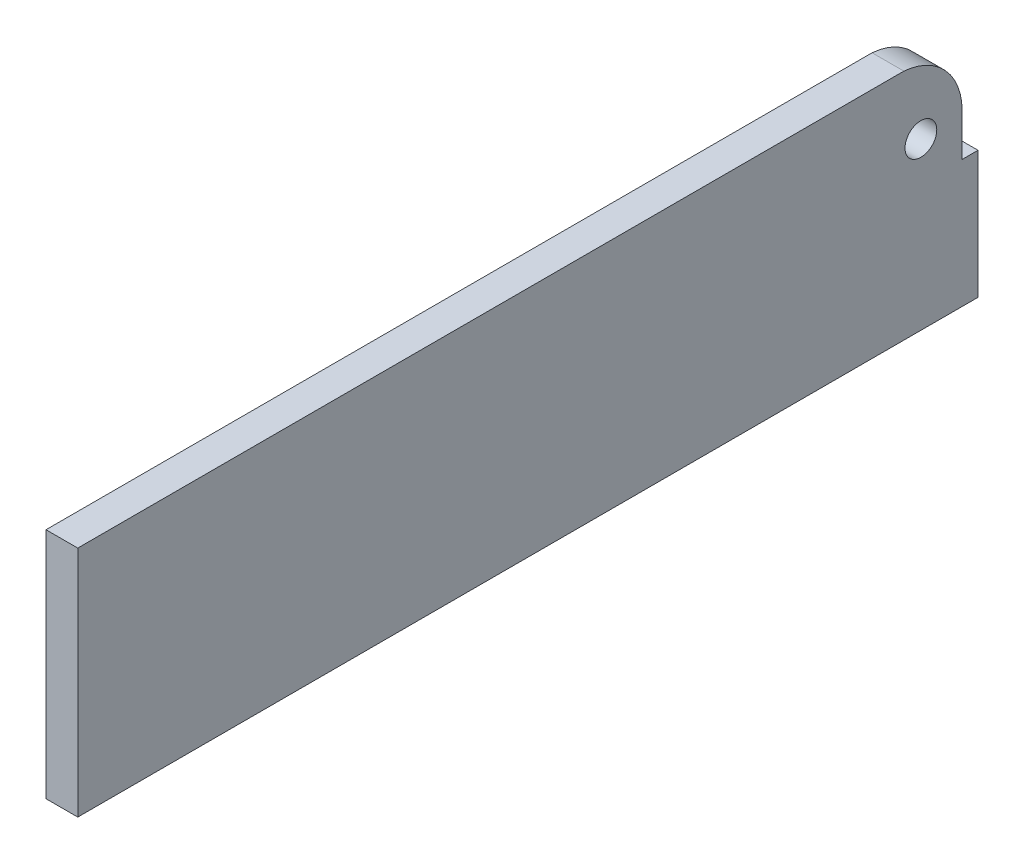
ISO-10303-21;
HEADER;
FILE_DESCRIPTION(('STEP AP214'),'2;1');
FILE_NAME('part.step','',(''),(''),'','','');
FILE_SCHEMA(('AUTOMOTIVE_DESIGN { 1 0 10303 214 1 1 1 1 }'));
ENDSEC;
DATA;
#1=APPLICATION_CONTEXT('core data for automotive mechanical design processes');
#2=APPLICATION_PROTOCOL_DEFINITION('international standard','automotive_design',2000,#1);
#3=PRODUCT_CONTEXT('',#1,'mechanical');
#4=PRODUCT('Part','Part','',(#3));
#5=PRODUCT_RELATED_PRODUCT_CATEGORY('part','',(#4));
#6=PRODUCT_DEFINITION_FORMATION('','',#4);
#7=PRODUCT_DEFINITION_CONTEXT('part definition',#1,'design');
#8=PRODUCT_DEFINITION('design','',#6,#7);
#9=PRODUCT_DEFINITION_SHAPE('','',#8);
#10=(LENGTH_UNIT() NAMED_UNIT(*) SI_UNIT(.MILLI.,.METRE.));
#11=(NAMED_UNIT(*) PLANE_ANGLE_UNIT() SI_UNIT($,.RADIAN.));
#12=(NAMED_UNIT(*) SI_UNIT($,.STERADIAN.) SOLID_ANGLE_UNIT());
#13=UNCERTAINTY_MEASURE_WITH_UNIT(LENGTH_MEASURE(1.E-05),#10,'distance_accuracy_value','');
#14=(GEOMETRIC_REPRESENTATION_CONTEXT(3) GLOBAL_UNCERTAINTY_ASSIGNED_CONTEXT((#13)) GLOBAL_UNIT_ASSIGNED_CONTEXT((#10,
#11,#12)) REPRESENTATION_CONTEXT('',''));
#15=CARTESIAN_POINT('',(0.,0.,0.));
#16=DIRECTION('',(0.,0.,1.));
#17=DIRECTION('',(1.,0.,0.));
#18=AXIS2_PLACEMENT_3D('',#15,#16,#17);
#19=CARTESIAN_POINT('',(3.,5.52642049622653,-35.0087088921518));
#20=DIRECTION('',(-1.,0.,0.));
#21=DIRECTION('',(0.,0.,1.));
#22=AXIS2_PLACEMENT_3D('',#19,#20,#21);
#23=PLANE('',#22);
#24=DIRECTION('',(0.,-1.,0.));
#25=VECTOR('',#24,1.);
#26=CARTESIAN_POINT('',(3.,-10.5024655217488,42.5));
#27=LINE('',#26,#25);
#28=CARTESIAN_POINT('',(3.,11.4975344782512,42.5));
#29=VERTEX_POINT('',#28);
#30=CARTESIAN_POINT('',(3.,-10.5024655217488,42.5));
#31=VERTEX_POINT('',#30);
#32=EDGE_CURVE('E136',#29,#31,#27,.T.);
#33=ORIENTED_EDGE('',*,*,#32,.T.);
#34=DIRECTION('',(0.,0.,-1.));
#35=VECTOR('',#34,1.);
#36=CARTESIAN_POINT('',(3.,-10.5024655217488,42.5));
#37=LINE('',#36,#35);
#38=CARTESIAN_POINT('',(3.,-10.5024655217488,-42.5));
#39=VERTEX_POINT('',#38);
#40=EDGE_CURVE('E89',#31,#39,#37,.T.);
#41=ORIENTED_EDGE('',*,*,#40,.T.);
#42=DIRECTION('',(0.,1.,0.));
#43=VECTOR('',#42,1.);
#44=CARTESIAN_POINT('',(3.,-10.5024655217488,-42.5));
#45=LINE('',#44,#43);
#46=CARTESIAN_POINT('',(3.,1.52642049622653,-42.5));
#47=VERTEX_POINT('',#46);
#48=EDGE_CURVE('E148',#39,#47,#45,.T.);
#49=ORIENTED_EDGE('',*,*,#48,.T.);
#50=DIRECTION('',(0.,0.,1.));
#51=VECTOR('',#50,1.);
#52=CARTESIAN_POINT('',(3.,1.52642049622653,-41.));
#53=LINE('',#52,#51);
#54=CARTESIAN_POINT('',(3.,1.52642049622653,-41.));
#55=VERTEX_POINT('',#54);
#56=EDGE_CURVE('E105',#47,#55,#53,.T.);
#57=ORIENTED_EDGE('',*,*,#56,.T.);
#58=DIRECTION('',(0.,1.,0.));
#59=VECTOR('',#58,1.);
#60=CARTESIAN_POINT('',(3.,1.52642049622653,-41.));
#61=LINE('',#60,#59);
#62=CARTESIAN_POINT('',(3.,5.52642049622654,-41.));
#63=VERTEX_POINT('',#62);
#64=EDGE_CURVE('E99',#55,#63,#61,.T.);
#65=ORIENTED_EDGE('',*,*,#64,.T.);
#66=CARTESIAN_POINT('',(3.,5.52642049622653,-35.0087088921518));
#67=DIRECTION('',(1.,0.,0.));
#68=DIRECTION('',(0.,0.,1.));
#69=AXIS2_PLACEMENT_3D('',#66,#67,#68);
#70=CIRCLE('',#69,5.99129110784822);
#71=CARTESIAN_POINT('',(3.,11.4975344782512,-35.5));
#72=VERTEX_POINT('',#71);
#73=EDGE_CURVE('E103',#63,#72,#70,.T.);
#74=ORIENTED_EDGE('',*,*,#73,.T.);
#75=DIRECTION('',(0.,0.,1.));
#76=VECTOR('',#75,1.);
#77=CARTESIAN_POINT('',(3.,11.4975344782512,42.5));
#78=LINE('',#77,#76);
#79=EDGE_CURVE('E49',#72,#29,#78,.T.);
#80=ORIENTED_EDGE('',*,*,#79,.T.);
#81=EDGE_LOOP('',(#33,#41,#49,#57,#65,#74,#80));
#82=FACE_BOUND('',#81,.T.);
#83=CARTESIAN_POINT('',(3.,5.14776980357318,-37.1070068157879));
#84=DIRECTION('',(1.,0.,0.));
#85=DIRECTION('',(0.,0.,-1.));
#86=AXIS2_PLACEMENT_3D('',#83,#84,#85);
#87=CIRCLE('',#86,1.5);
#88=CARTESIAN_POINT('',(3.,5.14776980357318,-38.6070068157879));
#89=VERTEX_POINT('',#88);
#90=EDGE_CURVE('E127',#89,#89,#87,.T.);
#91=ORIENTED_EDGE('',*,*,#90,.F.);
#92=EDGE_LOOP('',(#91));
#93=FACE_BOUND('',#92,.T.);
#94=ADVANCED_FACE('F32',(#82,#93),#23,.F.);
#95=CARTESIAN_POINT('',(0.,5.52642049622653,-35.0087088921518));
#96=DIRECTION('',(-1.,0.,0.));
#97=DIRECTION('',(0.,0.,1.));
#98=AXIS2_PLACEMENT_3D('',#95,#96,#97);
#99=PLANE('',#98);
#100=DIRECTION('',(0.,-1.,0.));
#101=VECTOR('',#100,1.);
#102=CARTESIAN_POINT('',(0.,-10.5024655217488,42.5));
#103=LINE('',#102,#101);
#104=CARTESIAN_POINT('',(0.,11.4975344782512,42.5));
#105=VERTEX_POINT('',#104);
#106=CARTESIAN_POINT('',(0.,-10.5024655217488,42.5));
#107=VERTEX_POINT('',#106);
#108=EDGE_CURVE('E123',#105,#107,#103,.T.);
#109=ORIENTED_EDGE('',*,*,#108,.F.);
#110=DIRECTION('',(0.,0.,1.));
#111=VECTOR('',#110,1.);
#112=CARTESIAN_POINT('',(0.,11.4975344782512,42.5));
#113=LINE('',#112,#111);
#114=CARTESIAN_POINT('',(0.,11.4975344782512,-35.5));
#115=VERTEX_POINT('',#114);
#116=EDGE_CURVE('E81',#115,#105,#113,.T.);
#117=ORIENTED_EDGE('',*,*,#116,.F.);
#118=CARTESIAN_POINT('',(0.,5.52642049622653,-35.0087088921518));
#119=DIRECTION('',(1.,0.,0.));
#120=DIRECTION('',(0.,0.,1.));
#121=AXIS2_PLACEMENT_3D('',#118,#119,#120);
#122=CIRCLE('',#121,5.99129110784822);
#123=CARTESIAN_POINT('',(0.,5.52642049622654,-41.));
#124=VERTEX_POINT('',#123);
#125=EDGE_CURVE('E75',#124,#115,#122,.T.);
#126=ORIENTED_EDGE('',*,*,#125,.F.);
#127=DIRECTION('',(0.,1.,0.));
#128=VECTOR('',#127,1.);
#129=CARTESIAN_POINT('',(0.,1.52642049622653,-41.));
#130=LINE('',#129,#128);
#131=CARTESIAN_POINT('',(0.,1.52642049622653,-41.));
#132=VERTEX_POINT('',#131);
#133=EDGE_CURVE('E113',#132,#124,#130,.T.);
#134=ORIENTED_EDGE('',*,*,#133,.F.);
#135=DIRECTION('',(0.,0.,1.));
#136=VECTOR('',#135,1.);
#137=CARTESIAN_POINT('',(0.,1.52642049622653,-41.));
#138=LINE('',#137,#136);
#139=CARTESIAN_POINT('',(0.,1.52642049622653,-42.5));
#140=VERTEX_POINT('',#139);
#141=EDGE_CURVE('E131',#140,#132,#138,.T.);
#142=ORIENTED_EDGE('',*,*,#141,.F.);
#143=DIRECTION('',(0.,1.,0.));
#144=VECTOR('',#143,1.);
#145=CARTESIAN_POINT('',(0.,-10.5024655217488,-42.5));
#146=LINE('',#145,#144);
#147=CARTESIAN_POINT('',(0.,-10.5024655217488,-42.5));
#148=VERTEX_POINT('',#147);
#149=EDGE_CURVE('E129',#148,#140,#146,.T.);
#150=ORIENTED_EDGE('',*,*,#149,.F.);
#151=DIRECTION('',(0.,0.,-1.));
#152=VECTOR('',#151,1.);
#153=CARTESIAN_POINT('',(0.,-10.5024655217488,42.5));
#154=LINE('',#153,#152);
#155=EDGE_CURVE('E126',#107,#148,#154,.T.);
#156=ORIENTED_EDGE('',*,*,#155,.F.);
#157=EDGE_LOOP('',(#109,#117,#126,#134,#142,#150,#156));
#158=FACE_BOUND('',#157,.T.);
#159=CARTESIAN_POINT('',(0.,5.14776980357318,-37.1070068157879));
#160=DIRECTION('',(1.,0.,0.));
#161=DIRECTION('',(0.,0.,-1.));
#162=AXIS2_PLACEMENT_3D('',#159,#160,#161);
#163=CIRCLE('',#162,1.5);
#164=CARTESIAN_POINT('',(0.,5.14776980357318,-38.6070068157879));
#165=VERTEX_POINT('',#164);
#166=EDGE_CURVE('E160',#165,#165,#163,.T.);
#167=ORIENTED_EDGE('',*,*,#166,.T.);
#168=EDGE_LOOP('',(#167));
#169=FACE_BOUND('',#168,.T.);
#170=ADVANCED_FACE('F152',(#158,#169),#99,.T.);
#171=CARTESIAN_POINT('',(3.,-10.5024655217488,42.5));
#172=DIRECTION('',(0.,0.,-1.));
#173=DIRECTION('',(-1.,0.,0.));
#174=AXIS2_PLACEMENT_3D('',#171,#172,#173);
#175=PLANE('',#174);
#176=ORIENTED_EDGE('',*,*,#108,.T.);
#177=DIRECTION('',(-1.,0.,0.));
#178=VECTOR('',#177,1.);
#179=CARTESIAN_POINT('',(3.,-10.5024655217488,42.5));
#180=LINE('',#179,#178);
#181=EDGE_CURVE('E11',#31,#107,#180,.T.);
#182=ORIENTED_EDGE('',*,*,#181,.F.);
#183=ORIENTED_EDGE('',*,*,#32,.F.);
#184=DIRECTION('',(-1.,0.,0.));
#185=VECTOR('',#184,1.);
#186=CARTESIAN_POINT('',(3.,11.4975344782512,42.5));
#187=LINE('',#186,#185);
#188=EDGE_CURVE('E119',#29,#105,#187,.T.);
#189=ORIENTED_EDGE('',*,*,#188,.T.);
#190=EDGE_LOOP('',(#176,#182,#183,#189));
#191=FACE_BOUND('',#190,.T.);
#192=ADVANCED_FACE('F34',(#191),#175,.F.);
#193=CARTESIAN_POINT('',(3.,-10.5024655217488,42.5));
#194=DIRECTION('',(0.,1.,0.));
#195=DIRECTION('',(0.,0.,1.));
#196=AXIS2_PLACEMENT_3D('',#193,#194,#195);
#197=PLANE('',#196);
#198=ORIENTED_EDGE('',*,*,#155,.T.);
#199=DIRECTION('',(-1.,0.,0.));
#200=VECTOR('',#199,1.);
#201=CARTESIAN_POINT('',(3.,-10.5024655217488,-42.5));
#202=LINE('',#201,#200);
#203=EDGE_CURVE('E41',#39,#148,#202,.T.);
#204=ORIENTED_EDGE('',*,*,#203,.F.);
#205=ORIENTED_EDGE('',*,*,#40,.F.);
#206=ORIENTED_EDGE('',*,*,#181,.T.);
#207=EDGE_LOOP('',(#198,#204,#205,#206));
#208=FACE_BOUND('',#207,.T.);
#209=ADVANCED_FACE('F186',(#208),#197,.F.);
#210=CARTESIAN_POINT('',(3.,-10.5024655217488,-42.5));
#211=DIRECTION('',(0.,0.,1.));
#212=DIRECTION('',(1.,0.,0.));
#213=AXIS2_PLACEMENT_3D('',#210,#211,#212);
#214=PLANE('',#213);
#215=ORIENTED_EDGE('',*,*,#149,.T.);
#216=DIRECTION('',(-1.,0.,0.));
#217=VECTOR('',#216,1.);
#218=CARTESIAN_POINT('',(3.,1.52642049622653,-42.5));
#219=LINE('',#218,#217);
#220=EDGE_CURVE('E140',#47,#140,#219,.T.);
#221=ORIENTED_EDGE('',*,*,#220,.F.);
#222=ORIENTED_EDGE('',*,*,#48,.F.);
#223=ORIENTED_EDGE('',*,*,#203,.T.);
#224=EDGE_LOOP('',(#215,#221,#222,#223));
#225=FACE_BOUND('',#224,.T.);
#226=ADVANCED_FACE('F146',(#225),#214,.F.);
#227=CARTESIAN_POINT('',(3.,1.52642049622653,-41.));
#228=DIRECTION('',(0.,-1.,0.));
#229=DIRECTION('',(0.,0.,-1.));
#230=AXIS2_PLACEMENT_3D('',#227,#228,#229);
#231=PLANE('',#230);
#232=ORIENTED_EDGE('',*,*,#141,.T.);
#233=DIRECTION('',(-1.,0.,0.));
#234=VECTOR('',#233,1.);
#235=CARTESIAN_POINT('',(3.,1.52642049622653,-41.));
#236=LINE('',#235,#234);
#237=EDGE_CURVE('E114',#55,#132,#236,.T.);
#238=ORIENTED_EDGE('',*,*,#237,.F.);
#239=ORIENTED_EDGE('',*,*,#56,.F.);
#240=ORIENTED_EDGE('',*,*,#220,.T.);
#241=EDGE_LOOP('',(#232,#238,#239,#240));
#242=FACE_BOUND('',#241,.T.);
#243=ADVANCED_FACE('F155',(#242),#231,.F.);
#244=CARTESIAN_POINT('',(3.,1.52642049622653,-41.));
#245=DIRECTION('',(0.,0.,1.));
#246=DIRECTION('',(1.,0.,0.));
#247=AXIS2_PLACEMENT_3D('',#244,#245,#246);
#248=PLANE('',#247);
#249=ORIENTED_EDGE('',*,*,#133,.T.);
#250=DIRECTION('',(-1.,0.,0.));
#251=VECTOR('',#250,1.);
#252=CARTESIAN_POINT('',(3.,5.52642049622654,-41.));
#253=LINE('',#252,#251);
#254=EDGE_CURVE('E110',#63,#124,#253,.T.);
#255=ORIENTED_EDGE('',*,*,#254,.F.);
#256=ORIENTED_EDGE('',*,*,#64,.F.);
#257=ORIENTED_EDGE('',*,*,#237,.T.);
#258=EDGE_LOOP('',(#249,#255,#256,#257));
#259=FACE_BOUND('',#258,.T.);
#260=ADVANCED_FACE('F111',(#259),#248,.F.);
#261=CARTESIAN_POINT('',(3.,5.52642049622653,-35.0087088921518));
#262=DIRECTION('',(-1.,0.,0.));
#263=DIRECTION('',(0.,0.,1.));
#264=AXIS2_PLACEMENT_3D('',#261,#262,#263);
#265=CYLINDRICAL_SURFACE('',#264,5.99129110784822);
#266=ORIENTED_EDGE('',*,*,#125,.T.);
#267=DIRECTION('',(-1.,0.,0.));
#268=VECTOR('',#267,1.);
#269=CARTESIAN_POINT('',(3.,11.4975344782512,-35.5));
#270=LINE('',#269,#268);
#271=EDGE_CURVE('E115',#72,#115,#270,.T.);
#272=ORIENTED_EDGE('',*,*,#271,.F.);
#273=ORIENTED_EDGE('',*,*,#73,.F.);
#274=ORIENTED_EDGE('',*,*,#254,.T.);
#275=EDGE_LOOP('',(#266,#272,#273,#274));
#276=FACE_BOUND('',#275,.T.);
#277=ADVANCED_FACE('F117',(#276),#265,.T.);
#278=CARTESIAN_POINT('',(3.,11.4975344782512,42.5));
#279=DIRECTION('',(0.,-1.,0.));
#280=DIRECTION('',(0.,0.,-1.));
#281=AXIS2_PLACEMENT_3D('',#278,#279,#280);
#282=PLANE('',#281);
#283=ORIENTED_EDGE('',*,*,#116,.T.);
#284=ORIENTED_EDGE('',*,*,#188,.F.);
#285=ORIENTED_EDGE('',*,*,#79,.F.);
#286=ORIENTED_EDGE('',*,*,#271,.T.);
#287=EDGE_LOOP('',(#283,#284,#285,#286));
#288=FACE_BOUND('',#287,.T.);
#289=ADVANCED_FACE('F176',(#288),#282,.F.);
#290=CARTESIAN_POINT('',(3.,5.14776980357318,-37.1070068157879));
#291=DIRECTION('',(-1.,0.,0.));
#292=DIRECTION('',(0.,0.,1.));
#293=AXIS2_PLACEMENT_3D('',#290,#291,#292);
#294=CYLINDRICAL_SURFACE('',#293,1.5);
#295=ORIENTED_EDGE('',*,*,#90,.T.);
#296=EDGE_LOOP('',(#295));
#297=FACE_BOUND('',#296,.T.);
#298=ORIENTED_EDGE('',*,*,#166,.F.);
#299=EDGE_LOOP('',(#298));
#300=FACE_BOUND('',#299,.T.);
#301=ADVANCED_FACE('F166',(#297,#300),#294,.F.);
#302=CLOSED_SHELL('',(#94,#170,#192,#209,#226,#243,#260,#277,#289,#301));
#303=MANIFOLD_SOLID_BREP('B2',#302);
#304=ADVANCED_BREP_SHAPE_REPRESENTATION('',(#18,#303),#14);
#305=SHAPE_DEFINITION_REPRESENTATION(#9,#304);
ENDSEC;
END-ISO-10303-21;
